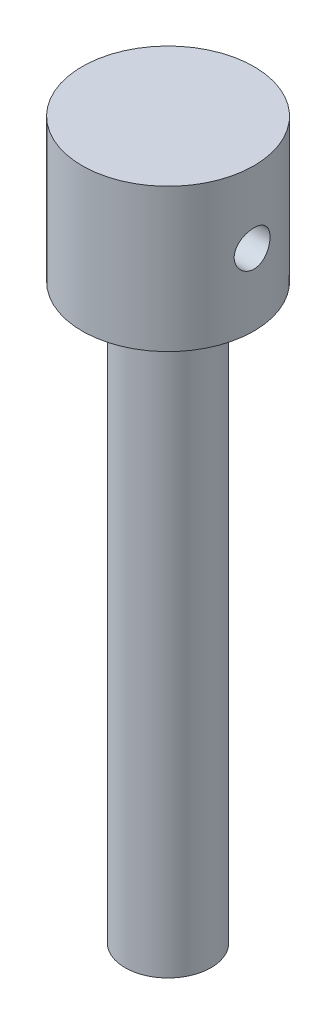
ISO-10303-21;
HEADER;
FILE_DESCRIPTION(('STEP AP214'),'2;1');
FILE_NAME('part.step','',(''),(''),'','','');
FILE_SCHEMA(('AUTOMOTIVE_DESIGN { 1 0 10303 214 1 1 1 1 }'));
ENDSEC;
DATA;
#1=APPLICATION_CONTEXT('core data for automotive mechanical design processes');
#2=APPLICATION_PROTOCOL_DEFINITION('international standard','automotive_design',2000,#1);
#3=PRODUCT_CONTEXT('',#1,'mechanical');
#4=PRODUCT('Part','Part','',(#3));
#5=PRODUCT_RELATED_PRODUCT_CATEGORY('part','',(#4));
#6=PRODUCT_DEFINITION_FORMATION('','',#4);
#7=PRODUCT_DEFINITION_CONTEXT('part definition',#1,'design');
#8=PRODUCT_DEFINITION('design','',#6,#7);
#9=PRODUCT_DEFINITION_SHAPE('','',#8);
#10=(LENGTH_UNIT() NAMED_UNIT(*) SI_UNIT(.MILLI.,.METRE.));
#11=(NAMED_UNIT(*) PLANE_ANGLE_UNIT() SI_UNIT($,.RADIAN.));
#12=(NAMED_UNIT(*) SI_UNIT($,.STERADIAN.) SOLID_ANGLE_UNIT());
#13=UNCERTAINTY_MEASURE_WITH_UNIT(LENGTH_MEASURE(1.E-05),#10,'distance_accuracy_value','');
#14=(GEOMETRIC_REPRESENTATION_CONTEXT(3) GLOBAL_UNCERTAINTY_ASSIGNED_CONTEXT((#13)) GLOBAL_UNIT_ASSIGNED_CONTEXT((#10,
#11,#12)) REPRESENTATION_CONTEXT('',''));
#15=CARTESIAN_POINT('',(0.,0.,0.));
#16=DIRECTION('',(0.,0.,1.));
#17=DIRECTION('',(1.,0.,0.));
#18=AXIS2_PLACEMENT_3D('',#15,#16,#17);
#19=CARTESIAN_POINT('',(0.,0.,0.));
#20=DIRECTION('',(0.,-1.,0.));
#21=DIRECTION('',(1.,0.,0.));
#22=AXIS2_PLACEMENT_3D('',#19,#20,#21);
#23=PLANE('',#22);
#24=CARTESIAN_POINT('',(0.,0.,0.));
#25=DIRECTION('',(0.,-1.,0.));
#26=DIRECTION('',(1.,0.,0.));
#27=AXIS2_PLACEMENT_3D('',#24,#25,#26);
#28=CIRCLE('',#27,6.);
#29=CARTESIAN_POINT('',(6.,0.,0.));
#30=VERTEX_POINT('',#29);
#31=EDGE_CURVE('E45',#30,#30,#28,.T.);
#32=ORIENTED_EDGE('',*,*,#31,.T.);
#33=EDGE_LOOP('',(#32));
#34=FACE_BOUND('',#33,.T.);
#35=ADVANCED_FACE('F30',(#34),#23,.T.);
#36=CARTESIAN_POINT('',(3.49148133884313E-12,-1000.,0.));
#37=DIRECTION('',(0.,-1.,0.));
#38=DIRECTION('',(1.,0.,0.));
#39=AXIS2_PLACEMENT_3D('',#36,#37,#38);
#40=CYLINDRICAL_SURFACE('',#39,6.00000000000014);
#41=CARTESIAN_POINT('',(-2.79318507107451E-13,80.0000000000001,0.));
#42=DIRECTION('',(0.,-1.,0.));
#43=DIRECTION('',(1.,0.,0.));
#44=AXIS2_PLACEMENT_3D('',#41,#42,#43);
#45=CIRCLE('',#44,6.00000000000028);
#46=CARTESIAN_POINT('',(6.,80.0000000000001,0.));
#47=VERTEX_POINT('',#46);
#48=EDGE_CURVE('E49',#47,#47,#45,.T.);
#49=ORIENTED_EDGE('',*,*,#48,.T.);
#50=EDGE_LOOP('',(#49));
#51=FACE_BOUND('',#50,.T.);
#52=ORIENTED_EDGE('',*,*,#31,.F.);
#53=EDGE_LOOP('',(#52));
#54=FACE_BOUND('',#53,.T.);
#55=ADVANCED_FACE('F73',(#51,#54),#40,.T.);
#56=CARTESIAN_POINT('',(6.,80.,0.));
#57=DIRECTION('',(0.,-1.,0.));
#58=DIRECTION('',(1.,0.,0.));
#59=AXIS2_PLACEMENT_3D('',#56,#57,#58);
#60=PLANE('',#59);
#61=CARTESIAN_POINT('',(-2.79318507107451E-13,80.0000000000001,0.));
#62=DIRECTION('',(0.,-1.,0.));
#63=DIRECTION('',(1.,0.,0.));
#64=AXIS2_PLACEMENT_3D('',#61,#62,#63);
#65=CIRCLE('',#64,12.0000000000003);
#66=CARTESIAN_POINT('',(12.,80.0000000000001,0.));
#67=VERTEX_POINT('',#66);
#68=EDGE_CURVE('E88',#67,#67,#65,.T.);
#69=ORIENTED_EDGE('',*,*,#68,.T.);
#70=EDGE_LOOP('',(#69));
#71=FACE_BOUND('',#70,.T.);
#72=ORIENTED_EDGE('',*,*,#48,.F.);
#73=EDGE_LOOP('',(#72));
#74=FACE_BOUND('',#73,.T.);
#75=ADVANCED_FACE('F69',(#71,#74),#60,.T.);
#76=CARTESIAN_POINT('',(3.49148133884313E-12,-1000.,0.));
#77=DIRECTION('',(0.,-1.,0.));
#78=DIRECTION('',(1.,0.,0.));
#79=AXIS2_PLACEMENT_3D('',#76,#77,#78);
#80=CYLINDRICAL_SURFACE('',#79,12.0000000000003);
#81=CARTESIAN_POINT('',(-12.0000000000007,87.5000000000017,0.));
#82=CARTESIAN_POINT('',(-11.9999974305337,87.5000049549402,0.13881808340332));
#83=CARTESIAN_POINT('',(-11.9975665755015,87.5116013314393,0.277697579041749));
#84=CARTESIAN_POINT('',(-11.9881040198142,87.5576386990675,0.551522632533984));
#85=CARTESIAN_POINT('',(-11.9810688237856,87.5920970460756,0.686465120256622));
#86=CARTESIAN_POINT('',(-11.9631821839247,87.6827409098454,0.94841826458268));
#87=CARTESIAN_POINT('',(-11.9523345410535,87.7389047919995,1.07543667341837));
#88=CARTESIAN_POINT('',(-11.9279985561978,87.8712992177141,1.31824065721191));
#89=CARTESIAN_POINT('',(-11.9145103325201,87.9475288623134,1.43402673506865));
#90=CARTESIAN_POINT('',(-11.8861540004936,88.119072680383,1.65278064861766));
#91=CARTESIAN_POINT('',(-11.8712701169713,88.2146240024719,1.75556048832536));
#92=CARTESIAN_POINT('',(-11.8419131538496,88.421589318392,1.94375555353877));
#93=CARTESIAN_POINT('',(-11.8274401083343,88.5330046237463,2.02916934192196));
#94=CARTESIAN_POINT('',(-11.8003888519068,88.7699039375341,2.18102063354432));
#95=CARTESIAN_POINT('',(-11.7878309034972,88.8955167690072,2.247261093613));
#96=CARTESIAN_POINT('',(-11.766256813001,89.1563949035473,2.35762238696126));
#97=CARTESIAN_POINT('',(-11.757240289352,89.2916591648868,2.40174560335281));
#98=CARTESIAN_POINT('',(-11.7439300197231,89.565970474833,2.46600480267473));
#99=CARTESIAN_POINT('',(-11.7395711371179,89.7049367186713,2.48647195393596));
#100=CARTESIAN_POINT('',(-11.7358738143304,89.984393685727,2.50386715311228));
#101=CARTESIAN_POINT('',(-11.7365348160203,90.1248842377323,2.50079781789372));
#102=CARTESIAN_POINT('',(-11.7427434863841,90.4009620559521,2.47147438074392));
#103=CARTESIAN_POINT('',(-11.7482106735986,90.5365919593242,2.44560210465439));
#104=CARTESIAN_POINT('',(-11.7632887523195,90.8015430192916,2.37201087059889));
#105=CARTESIAN_POINT('',(-11.772899856827,90.9308638512144,2.32429078962762));
#106=CARTESIAN_POINT('',(-11.7952638292827,91.1806144568337,2.20800006427855));
#107=CARTESIAN_POINT('',(-11.8080390757124,91.3009725930559,2.13928005068471));
#108=CARTESIAN_POINT('',(-11.8352778002151,91.5285914885381,1.98304539854961));
#109=CARTESIAN_POINT('',(-11.8497414879714,91.6358506176737,1.89552842452514));
#110=CARTESIAN_POINT('',(-11.8790746185988,91.8364279221625,1.70214984309354));
#111=CARTESIAN_POINT('',(-11.8939464639901,91.9294323377958,1.59596286682414));
#112=CARTESIAN_POINT('',(-11.9221617628607,92.0963608844597,1.36933457722357));
#113=CARTESIAN_POINT('',(-11.9355051934054,92.1702847291985,1.24889305005151));
#114=CARTESIAN_POINT('',(-11.9591974188569,92.2970201630737,0.996811082470933));
#115=CARTESIAN_POINT('',(-11.9695407942058,92.349793609136,0.865150923852978));
#116=CARTESIAN_POINT('',(-11.9860267642263,92.4323834096727,0.594569241944289));
#117=CARTESIAN_POINT('',(-11.9921699119217,92.4622027864646,0.455648677190156));
#118=CARTESIAN_POINT('',(-11.9994855043097,92.4975885041375,0.177183731401645));
#119=CARTESIAN_POINT('',(-12.0007458707522,92.5035838829903,0.0376961110523311));
#120=CARTESIAN_POINT('',(-11.9983990450561,92.4923101000635,-0.240287597515457));
#121=CARTESIAN_POINT('',(-11.9947921509637,92.4750423627985,-0.378783745924545));
#122=CARTESIAN_POINT('',(-11.9831712995843,92.4180886930627,-0.649452734239657));
#123=CARTESIAN_POINT('',(-11.9752010573622,92.3786250292348,-0.781674385788444));
#124=CARTESIAN_POINT('',(-11.9557445448485,92.2786442791589,-1.03762289332269));
#125=CARTESIAN_POINT('',(-11.9442579948922,92.2181255182698,-1.16134907267358));
#126=CARTESIAN_POINT('',(-11.9188248298149,92.0768392435266,-1.39858861388702));
#127=CARTESIAN_POINT('',(-11.9048478762472,91.9958161408636,-1.51194643893969));
#128=CARTESIAN_POINT('',(-11.8760513659948,91.8161608738492,-1.72361089177307));
#129=CARTESIAN_POINT('',(-11.8612317108509,91.7175266489639,-1.8219157558266));
#130=CARTESIAN_POINT('',(-11.8321204906282,91.5034888460023,-2.00235729730363));
#131=CARTESIAN_POINT('',(-11.8178417861507,91.3878339360912,-2.08419829200411));
#132=CARTESIAN_POINT('',(-11.7917120203167,91.1441674315742,-2.22729438158489));
#133=CARTESIAN_POINT('',(-11.7798608578937,91.0161563517235,-2.28855033355731));
#134=CARTESIAN_POINT('',(-11.7600340141615,90.7520776074053,-2.38834492887847));
#135=CARTESIAN_POINT('',(-11.7520374556944,90.6160579256701,-2.42700619656065));
#136=CARTESIAN_POINT('',(-11.7407836941946,90.3392668990172,-2.48088077046816));
#137=CARTESIAN_POINT('',(-11.737525813208,90.1984962367629,-2.49609743088884));
#138=CARTESIAN_POINT('',(-11.7361581461708,89.9191731980024,-2.50251852975224));
#139=CARTESIAN_POINT('',(-11.7379480464307,89.7806318595576,-2.49419085245453));
#140=CARTESIAN_POINT('',(-11.7462489450992,89.5069719821613,-2.45479810628065));
#141=CARTESIAN_POINT('',(-11.7527598981931,89.3718534103695,-2.42373325564534));
#142=CARTESIAN_POINT('',(-11.7697226489549,89.1092044562204,-2.33996435537171));
#143=CARTESIAN_POINT('',(-11.7801631401592,88.9816535070279,-2.28732235136844));
#144=CARTESIAN_POINT('',(-11.8038141147754,88.7371224479484,-2.16194914599516));
#145=CARTESIAN_POINT('',(-11.8170248553098,88.6201433207355,-2.08921607966061));
#146=CARTESIAN_POINT('',(-11.8450315910235,88.3977567458428,-1.92414739068483));
#147=CARTESIAN_POINT('',(-11.8598522773687,88.2926017508718,-1.83147578083646));
#148=CARTESIAN_POINT('',(-11.8892367916649,88.099181013549,-1.62984887623067));
#149=CARTESIAN_POINT('',(-11.9038005596982,88.0109191648988,-1.52088983766594));
#150=CARTESIAN_POINT('',(-11.9312288909534,87.8528228536336,-1.28826885501541));
#151=CARTESIAN_POINT('',(-11.9440719214655,87.7832126402292,-1.1644518430427));
#152=CARTESIAN_POINT('',(-11.9663981698825,87.6658995431417,-0.906639687996915));
#153=CARTESIAN_POINT('',(-11.9758843236426,87.618177505638,-0.772653563814494));
#154=CARTESIAN_POINT('',(-11.9886499956295,87.5549194434249,-0.532030585800214));
#155=CARTESIAN_POINT('',(-11.9928807132285,87.534362473584,-0.426735187455859));
#156=CARTESIAN_POINT('',(-11.9985566557958,87.5069010914471,-0.214305348353073));
#157=CARTESIAN_POINT('',(-12.0000019836924,87.4999961746674,-0.107170975697743));
#158=CARTESIAN_POINT('',(-12.0000000000007,87.5000000000017,0.));
#159=B_SPLINE_CURVE_WITH_KNOTS('',3,(#81,#82,#83,#84,#85,#86,#87,#88,#89,#90,#91,#92,#93,#94,
#95,#96,#97,#98,#99,#100,#101,#102,#103,#104,#105,#106,#107,#108,#109,#110,#111,#112,#113,#114,
#115,#116,#117,#118,#119,#120,#121,#122,#123,#124,#125,#126,#127,#128,#129,#130,#131,#132,#133,
#134,#135,#136,#137,#138,#139,#140,#141,#142,#143,#144,#145,#146,#147,#148,#149,#150,#151,#152,
#153,#154,#155,#156,#157,#158),.UNSPECIFIED.,.T.,.F.,(4,2,2,2,2,2,2,2,2,2,2,2,2,2,2,2,2,2,2,2,2,
2,2,2,2,2,2,2,2,2,2,2,2,2,2,2,2,2,4),(0.,0.416062090206366,0.832440399812448,1.24840475765088,
1.66435048314598,2.08575052776243,2.5071854310357,2.93280898357095,3.3583866657098,
3.77793150339709,4.1974296953433,4.61003424258118,5.02266000060559,5.43829184833499,
5.85397536736069,6.27779052710932,6.70161204556435,7.12619448999325,7.55072102091542,
7.96756678815351,8.38438703104555,8.79710573265243,9.20985726781867,9.62803167991473,
10.0462550512915,10.4714252765867,10.8965777970262,11.3194010019005,11.7421637082837,
12.1565844658208,12.5710012456272,12.9842346278651,13.3975063816296,13.8183804966062,
14.2393515023474,14.6651772879651,15.0906297292995,15.4118517695456,15.7330619394678),.UNSPECIFIED.);
#160=CARTESIAN_POINT('',(-12.0000000000007,87.5000000000017,0.));
#161=VERTEX_POINT('',#160);
#162=EDGE_CURVE('E10',#161,#161,#159,.T.);
#163=ORIENTED_EDGE('',*,*,#162,.F.);
#164=EDGE_LOOP('',(#163));
#165=FACE_BOUND('',#164,.T.);
#166=CARTESIAN_POINT('',(12.,92.5000000000016,0.));
#167=CARTESIAN_POINT('',(11.999997430533,92.4999950450632,0.138818083403326));
#168=CARTESIAN_POINT('',(11.9975665755008,92.4883986685642,0.27769757904176));
#169=CARTESIAN_POINT('',(11.9881040198136,92.4423613009361,0.551522632533995));
#170=CARTESIAN_POINT('',(11.981068823785,92.4079029539279,0.686465120256628));
#171=CARTESIAN_POINT('',(11.963182183924,92.3172590901581,0.948418264582677));
#172=CARTESIAN_POINT('',(11.9523345410529,92.261095208004,1.07543667341836));
#173=CARTESIAN_POINT('',(11.9279985561972,92.1287007822894,1.3182406572119));
#174=CARTESIAN_POINT('',(11.9145103325195,92.0524711376901,1.43402673506864));
#175=CARTESIAN_POINT('',(11.886154000493,91.8809273196205,1.65278064861767));
#176=CARTESIAN_POINT('',(11.8712701169706,91.7853759975316,1.75556048832536));
#177=CARTESIAN_POINT('',(11.841913153849,91.5784106816115,1.94375555353878));
#178=CARTESIAN_POINT('',(11.8274401083337,91.4669953762572,2.02916934192197));
#179=CARTESIAN_POINT('',(11.8003888519062,91.2300960624694,2.18102063354433));
#180=CARTESIAN_POINT('',(11.7878309034966,91.1044832309963,2.24726109361301));
#181=CARTESIAN_POINT('',(11.7662568130004,90.8436050964562,2.35762238696126));
#182=CARTESIAN_POINT('',(11.7572402893514,90.7083408351167,2.40174560335281));
#183=CARTESIAN_POINT('',(11.7439300197225,90.4340295251705,2.46600480267472));
#184=CARTESIAN_POINT('',(11.7395711371173,90.2950632813322,2.48647195393596));
#185=CARTESIAN_POINT('',(11.7358738143298,90.0156063142765,2.50386715311228));
#186=CARTESIAN_POINT('',(11.7365348160196,89.8751157622711,2.50079781789372));
#187=CARTESIAN_POINT('',(11.7427434863835,89.5990379440514,2.47147438074392));
#188=CARTESIAN_POINT('',(11.748210673598,89.4634080406793,2.44560210465439));
#189=CARTESIAN_POINT('',(11.7632887523188,89.1984569807119,2.37201087059889));
#190=CARTESIAN_POINT('',(11.7728998568264,89.0691361487891,2.32429078962762));
#191=CARTESIAN_POINT('',(11.795263829282,88.8193855431698,2.20800006427855));
#192=CARTESIAN_POINT('',(11.8080390757117,88.6990274069476,2.13928005068472));
#193=CARTESIAN_POINT('',(11.8352778002144,88.4714085114654,1.98304539854961));
#194=CARTESIAN_POINT('',(11.8497414879708,88.3641493823298,1.89552842452515));
#195=CARTESIAN_POINT('',(11.8790746185982,88.163572077841,1.70214984309353));
#196=CARTESIAN_POINT('',(11.8939464639895,88.0705676622077,1.59596286682413));
#197=CARTESIAN_POINT('',(11.92216176286,87.9036391155438,1.36933457722356));
#198=CARTESIAN_POINT('',(11.9355051934047,87.8297152708049,1.2488930500515));
#199=CARTESIAN_POINT('',(11.9591974188563,87.7029798369298,0.99681108247092));
#200=CARTESIAN_POINT('',(11.9695407942052,87.6502063908675,0.865150923852966));
#201=CARTESIAN_POINT('',(11.9860267642256,87.5676165903308,0.594569241944281));
#202=CARTESIAN_POINT('',(11.9921699119211,87.5377972135389,0.455648677190152));
#203=CARTESIAN_POINT('',(11.9994855043091,87.502411495866,0.177183731401644));
#204=CARTESIAN_POINT('',(12.0007458707516,87.4964161170132,0.0376961110523302));
#205=CARTESIAN_POINT('',(11.9983990450555,87.5076898999399,-0.240287597515459));
#206=CARTESIAN_POINT('',(11.9947921509631,87.5249576372049,-0.378783745924547));
#207=CARTESIAN_POINT('',(11.9831712995837,87.5819113069408,-0.64945273423966));
#208=CARTESIAN_POINT('',(11.9752010573615,87.6213749707687,-0.781674385788446));
#209=CARTESIAN_POINT('',(11.9557445448479,87.7213557208446,-1.0376228933227));
#210=CARTESIAN_POINT('',(11.9442579948916,87.7818744817337,-1.16134907267358));
#211=CARTESIAN_POINT('',(11.9188248298143,87.9231607564769,-1.39858861388702));
#212=CARTESIAN_POINT('',(11.9048478762466,88.0041838591399,-1.5119464389397));
#213=CARTESIAN_POINT('',(11.8760513659942,88.1838391261543,-1.72361089177307));
#214=CARTESIAN_POINT('',(11.8612317108502,88.2824733510396,-1.8219157558266));
#215=CARTESIAN_POINT('',(11.8321204906275,88.4965111540012,-2.00235729730363));
#216=CARTESIAN_POINT('',(11.81784178615,88.6121660639123,-2.08419829200411));
#217=CARTESIAN_POINT('',(11.7917120203161,88.8558325684293,-2.22729438158489));
#218=CARTESIAN_POINT('',(11.779860857893,88.98384364828,-2.28855033355731));
#219=CARTESIAN_POINT('',(11.7600340141608,89.2479223925982,-2.38834492887847));
#220=CARTESIAN_POINT('',(11.7520374556937,89.3839420743334,-2.42700619656065));
#221=CARTESIAN_POINT('',(11.7407836941939,89.6607331009863,-2.48088077046817));
#222=CARTESIAN_POINT('',(11.7375258132073,89.8015037632406,-2.49609743088884));
#223=CARTESIAN_POINT('',(11.7361581461701,90.0808268020011,-2.50251852975224));
#224=CARTESIAN_POINT('',(11.73794804643,90.2193681404459,-2.49419085245453));
#225=CARTESIAN_POINT('',(11.7462489450985,90.4930280178422,-2.45479810628065));
#226=CARTESIAN_POINT('',(11.7527598981925,90.628146589634,-2.42373325564534));
#227=CARTESIAN_POINT('',(11.7697226489543,90.8907955437831,-2.33996435537171));
#228=CARTESIAN_POINT('',(11.7801631401586,91.0183464929756,-2.28732235136844));
#229=CARTESIAN_POINT('',(11.8038141147748,91.2628775520551,-2.16194914599516));
#230=CARTESIAN_POINT('',(11.8170248553092,91.379856679268,-2.08921607966061));
#231=CARTESIAN_POINT('',(11.8450315910229,91.6022432541607,-1.92414739068483));
#232=CARTESIAN_POINT('',(11.8598522773681,91.7073982491317,-1.83147578083646));
#233=CARTESIAN_POINT('',(11.8892367916642,91.9008189864545,-1.62984887623068));
#234=CARTESIAN_POINT('',(11.9038005596976,91.9890808351047,-1.52088983766595));
#235=CARTESIAN_POINT('',(11.9312288909527,92.1471771463699,-1.28826885501541));
#236=CARTESIAN_POINT('',(11.9440719214649,92.2167873597743,-1.1644518430427));
#237=CARTESIAN_POINT('',(11.9663981698818,92.3341004568618,-0.906639687996907));
#238=CARTESIAN_POINT('',(11.975884323642,92.3818224943655,-0.77265356381449));
#239=CARTESIAN_POINT('',(11.9886499956289,92.4450805565786,-0.532030585800218));
#240=CARTESIAN_POINT('',(11.9928807132279,92.4656375264195,-0.426735187455868));
#241=CARTESIAN_POINT('',(11.9985566557952,92.4930989085564,-0.214305348353083));
#242=CARTESIAN_POINT('',(12.0000019836917,92.500003825336,-0.107170975697748));
#243=CARTESIAN_POINT('',(12.,92.5000000000016,0.));
#244=B_SPLINE_CURVE_WITH_KNOTS('',3,(#166,#167,#168,#169,#170,#171,#172,#173,#174,#175,#176,
#177,#178,#179,#180,#181,#182,#183,#184,#185,#186,#187,#188,#189,#190,#191,#192,#193,#194,#195,
#196,#197,#198,#199,#200,#201,#202,#203,#204,#205,#206,#207,#208,#209,#210,#211,#212,#213,#214,
#215,#216,#217,#218,#219,#220,#221,#222,#223,#224,#225,#226,#227,#228,#229,#230,#231,#232,#233,
#234,#235,#236,#237,#238,#239,#240,#241,#242,#243),.UNSPECIFIED.,.T.,.F.,(4,2,2,2,2,2,2,2,2,2,2,
2,2,2,2,2,2,2,2,2,2,2,2,2,2,2,2,2,2,2,2,2,2,2,2,2,2,2,4),(0.,0.416062090206368,0.83244039981244,
1.24840475765086,1.66435048314597,2.08575052776244,2.50718543103571,2.93280898357095,
3.35838666570979,3.77793150339706,4.19742969534329,4.61003424258117,5.02266000060557,
5.43829184833497,5.85397536736068,6.27779052710931,6.70161204556436,7.12619448999324,
7.55072102091541,7.9675667881535,8.38438703104554,8.79710573265243,9.20985726781866,
9.62803167991474,10.0462550512915,10.4714252765867,10.8965777970262,11.3194010019005,
11.7421637082837,12.1565844658208,12.5710012456272,12.9842346278651,13.3975063816296,
13.8183804966062,14.2393515023474,14.6651772879651,15.0906297292995,15.4118517695456,
15.7330619394678),.UNSPECIFIED.);
#245=CARTESIAN_POINT('',(12.,92.5000000000016,0.));
#246=VERTEX_POINT('',#245);
#247=EDGE_CURVE('E41',#246,#246,#244,.T.);
#248=ORIENTED_EDGE('',*,*,#247,.F.);
#249=EDGE_LOOP('',(#248));
#250=FACE_BOUND('',#249,.T.);
#251=CARTESIAN_POINT('',(-3.49148133884313E-13,100.,0.));
#252=DIRECTION('',(0.,-1.,0.));
#253=DIRECTION('',(1.,0.,0.));
#254=AXIS2_PLACEMENT_3D('',#251,#252,#253);
#255=CIRCLE('',#254,12.0000000000003);
#256=CARTESIAN_POINT('',(12.,100.,0.));
#257=VERTEX_POINT('',#256);
#258=EDGE_CURVE('E90',#257,#257,#255,.T.);
#259=ORIENTED_EDGE('',*,*,#258,.T.);
#260=EDGE_LOOP('',(#259));
#261=FACE_BOUND('',#260,.T.);
#262=ORIENTED_EDGE('',*,*,#68,.F.);
#263=EDGE_LOOP('',(#262));
#264=FACE_BOUND('',#263,.T.);
#265=ADVANCED_FACE('F55',(#165,#250,#261,#264),#80,.T.);
#266=CARTESIAN_POINT('',(12.,100.,0.));
#267=DIRECTION('',(0.,1.,0.));
#268=DIRECTION('',(-1.,0.,0.));
#269=AXIS2_PLACEMENT_3D('',#266,#267,#268);
#270=PLANE('',#269);
#271=ORIENTED_EDGE('',*,*,#258,.F.);
#272=EDGE_LOOP('',(#271));
#273=FACE_BOUND('',#272,.T.);
#274=ADVANCED_FACE('F62',(#273),#270,.T.);
#275=CARTESIAN_POINT('',(-12.0000000000007,90.0000000000017,0.));
#276=DIRECTION('',(1.,0.,0.));
#277=DIRECTION('',(0.,0.,-1.));
#278=AXIS2_PLACEMENT_3D('',#275,#276,#277);
#279=CYLINDRICAL_SURFACE('',#278,2.5);
#280=ORIENTED_EDGE('',*,*,#247,.T.);
#281=EDGE_LOOP('',(#280));
#282=FACE_BOUND('',#281,.T.);
#283=ORIENTED_EDGE('',*,*,#162,.T.);
#284=EDGE_LOOP('',(#283));
#285=FACE_BOUND('',#284,.T.);
#286=ADVANCED_FACE('F59',(#282,#285),#279,.F.);
#287=CLOSED_SHELL('',(#35,#55,#75,#265,#274,#286));
#288=MANIFOLD_SOLID_BREP('B2',#287);
#289=ADVANCED_BREP_SHAPE_REPRESENTATION('',(#18,#288),#14);
#290=SHAPE_DEFINITION_REPRESENTATION(#9,#289);
ENDSEC;
END-ISO-10303-21;
